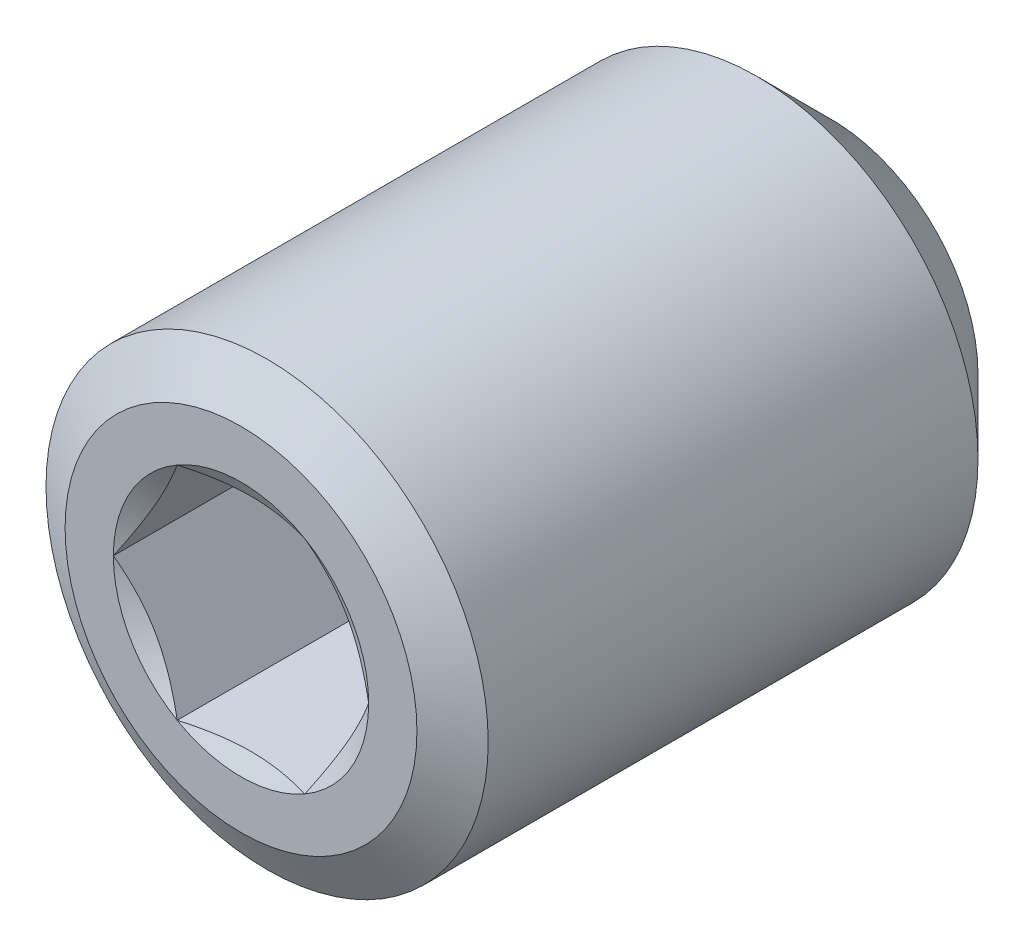
ISO-10303-21;
HEADER;
FILE_DESCRIPTION(('STEP AP214'),'2;1');
FILE_NAME('part.step','',(''),(''),'','','');
FILE_SCHEMA(('AUTOMOTIVE_DESIGN { 1 0 10303 214 1 1 1 1 }'));
ENDSEC;
DATA;
#1=APPLICATION_CONTEXT('core data for automotive mechanical design processes');
#2=APPLICATION_PROTOCOL_DEFINITION('international standard','automotive_design',2000,#1);
#3=PRODUCT_CONTEXT('',#1,'mechanical');
#4=PRODUCT('Part','Part','',(#3));
#5=PRODUCT_RELATED_PRODUCT_CATEGORY('part','',(#4));
#6=PRODUCT_DEFINITION_FORMATION('','',#4);
#7=PRODUCT_DEFINITION_CONTEXT('part definition',#1,'design');
#8=PRODUCT_DEFINITION('design','',#6,#7);
#9=PRODUCT_DEFINITION_SHAPE('','',#8);
#10=(LENGTH_UNIT() NAMED_UNIT(*) SI_UNIT(.MILLI.,.METRE.));
#11=(NAMED_UNIT(*) PLANE_ANGLE_UNIT() SI_UNIT($,.RADIAN.));
#12=(NAMED_UNIT(*) SI_UNIT($,.STERADIAN.) SOLID_ANGLE_UNIT());
#13=UNCERTAINTY_MEASURE_WITH_UNIT(LENGTH_MEASURE(1.E-05),#10,'distance_accuracy_value','');
#14=(GEOMETRIC_REPRESENTATION_CONTEXT(3) GLOBAL_UNCERTAINTY_ASSIGNED_CONTEXT((#13)) GLOBAL_UNIT_ASSIGNED_CONTEXT((#10,
#11,#12)) REPRESENTATION_CONTEXT('',''));
#15=CARTESIAN_POINT('',(0.,0.,0.));
#16=DIRECTION('',(0.,0.,1.));
#17=DIRECTION('',(1.,0.,0.));
#18=AXIS2_PLACEMENT_3D('',#15,#16,#17);
#19=CARTESIAN_POINT('',(5.4,0.,6.05));
#20=DIRECTION('',(0.,0.,-1.));
#21=DIRECTION('',(-1.,0.,0.));
#22=AXIS2_PLACEMENT_3D('',#19,#20,#21);
#23=PLANE('',#22);
#24=DIRECTION('',(1.,0.,0.));
#25=VECTOR('',#24,1.);
#26=CARTESIAN_POINT('',(5.83301270189222,0.75,6.05));
#27=LINE('',#26,#25);
#28=CARTESIAN_POINT('',(5.83301270189222,0.75,6.05));
#29=VERTEX_POINT('',#28);
#30=CARTESIAN_POINT('',(4.96698729810778,0.75,6.05));
#31=VERTEX_POINT('',#30);
#32=EDGE_CURVE('E115',#29,#31,#27,.F.);
#33=ORIENTED_EDGE('',*,*,#32,.T.);
#34=DIRECTION('',(-0.5,-0.866025403784439,0.));
#35=VECTOR('',#34,1.);
#36=CARTESIAN_POINT('',(4.96698729810778,0.75,6.05));
#37=LINE('',#36,#35);
#38=CARTESIAN_POINT('',(4.53397459621556,0.,6.05));
#39=VERTEX_POINT('',#38);
#40=EDGE_CURVE('E81',#31,#39,#37,.T.);
#41=ORIENTED_EDGE('',*,*,#40,.T.);
#42=DIRECTION('',(0.5,-0.866025403784439,0.));
#43=VECTOR('',#42,1.);
#44=CARTESIAN_POINT('',(4.53397459621556,0.,6.05));
#45=LINE('',#44,#43);
#46=CARTESIAN_POINT('',(4.96698729810778,-0.75,6.05));
#47=VERTEX_POINT('',#46);
#48=EDGE_CURVE('E83',#39,#47,#45,.T.);
#49=ORIENTED_EDGE('',*,*,#48,.T.);
#50=DIRECTION('',(1.,0.,0.));
#51=VECTOR('',#50,1.);
#52=CARTESIAN_POINT('',(4.96698729810778,-0.75,6.05));
#53=LINE('',#52,#51);
#54=CARTESIAN_POINT('',(5.83301270189222,-0.75,6.05));
#55=VERTEX_POINT('',#54);
#56=EDGE_CURVE('E84',#47,#55,#53,.T.);
#57=ORIENTED_EDGE('',*,*,#56,.T.);
#58=DIRECTION('',(0.5,0.866025403784439,0.));
#59=VECTOR('',#58,1.);
#60=CARTESIAN_POINT('',(5.83301270189222,-0.75,6.05));
#61=LINE('',#60,#59);
#62=CARTESIAN_POINT('',(6.26602540378444,0.,6.05));
#63=VERTEX_POINT('',#62);
#64=EDGE_CURVE('E70',#55,#63,#61,.T.);
#65=ORIENTED_EDGE('',*,*,#64,.T.);
#66=DIRECTION('',(-0.5,0.866025403784439,0.));
#67=VECTOR('',#66,1.);
#68=CARTESIAN_POINT('',(6.26602540378444,0.,6.05));
#69=LINE('',#68,#67);
#70=EDGE_CURVE('E104',#63,#29,#69,.T.);
#71=ORIENTED_EDGE('',*,*,#70,.T.);
#72=EDGE_LOOP('',(#33,#41,#49,#57,#65,#71));
#73=FACE_BOUND('',#72,.T.);
#74=ADVANCED_FACE('F16',(#73),#23,.F.);
#75=CARTESIAN_POINT('',(4.96698729810778,-0.75,7.25));
#76=DIRECTION('',(0.,-1.,0.));
#77=DIRECTION('',(0.,0.,-1.));
#78=AXIS2_PLACEMENT_3D('',#75,#76,#77);
#79=PLANE('',#78);
#80=DIRECTION('',(0.,0.,1.));
#81=VECTOR('',#80,1.);
#82=CARTESIAN_POINT('',(5.83301270189222,-0.75,7.25));
#83=LINE('',#82,#81);
#84=CARTESIAN_POINT('',(5.83301270188439,-0.750000000021348,7.24999999999327));
#85=VERTEX_POINT('',#84);
#86=EDGE_CURVE('E90',#85,#55,#83,.F.);
#87=ORIENTED_EDGE('',*,*,#86,.T.);
#88=ORIENTED_EDGE('',*,*,#56,.F.);
#89=DIRECTION('',(0.,0.,1.));
#90=VECTOR('',#89,1.);
#91=CARTESIAN_POINT('',(4.96698729810778,-0.750000000000001,7.25));
#92=LINE('',#91,#90);
#93=CARTESIAN_POINT('',(4.96698729810162,-0.750000000010674,7.24999999999197));
#94=VERTEX_POINT('',#93);
#95=EDGE_CURVE('E57',#47,#94,#92,.T.);
#96=ORIENTED_EDGE('',*,*,#95,.T.);
#97=CARTESIAN_POINT('',(4.9669872980988,-0.75,7.24999999998745));
#98=CARTESIAN_POINT('',(5.00253334717891,-0.75,7.23973766481819));
#99=CARTESIAN_POINT('',(5.03836059706336,-0.75,7.23034220746279));
#100=CARTESIAN_POINT('',(5.11059708569754,-0.75,7.21373690236903));
#101=CARTESIAN_POINT('',(5.14700743833595,-0.75,7.20653194479867));
#102=CARTESIAN_POINT('',(5.21941958688233,-0.75,7.19494550076308));
#103=CARTESIAN_POINT('',(5.2554111877375,-0.75,7.19050224022856));
#104=CARTESIAN_POINT('',(5.32760203793876,-0.75,7.18453742650338));
#105=CARTESIAN_POINT('',(5.36380101896938,-0.75,7.18301270190296));
#106=CARTESIAN_POINT('',(5.43619898103062,-0.75,7.18301270190296));
#107=CARTESIAN_POINT('',(5.47239796206124,-0.75,7.18453742650338));
#108=CARTESIAN_POINT('',(5.5445888122625,-0.75,7.19050224022856));
#109=CARTESIAN_POINT('',(5.58058041311767,-0.75,7.19494550076308));
#110=CARTESIAN_POINT('',(5.65299256166405,-0.75,7.20653194479867));
#111=CARTESIAN_POINT('',(5.68940291430246,-0.75,7.21373690236903));
#112=CARTESIAN_POINT('',(5.76163940293664,-0.75,7.23034220746279));
#113=CARTESIAN_POINT('',(5.79746665282109,-0.75,7.23973766481819));
#114=CARTESIAN_POINT('',(5.8330127019012,-0.75,7.24999999998745));
#115=B_SPLINE_CURVE_WITH_KNOTS('',3,(#97,#98,#99,#100,#101,#102,#103,#104,#105,#106,#107,#108,
#109,#110,#111,#112,#113,#114),.UNSPECIFIED.,.F.,.F.,(4,2,2,2,2,2,2,2,4),(0.,0.111027523469266,
0.22230111978337,0.330986572190884,0.439553855000989,0.548121137811092,0.656806590218607,
0.76808018653271,0.879107710001977),.UNSPECIFIED.);
#116=EDGE_CURVE('E19',#94,#85,#115,.T.);
#117=ORIENTED_EDGE('',*,*,#116,.T.);
#118=EDGE_LOOP('',(#87,#88,#96,#117));
#119=FACE_BOUND('',#118,.T.);
#120=ADVANCED_FACE('F88',(#119),#79,.F.);
#121=CARTESIAN_POINT('',(4.53397459621556,0.,7.25));
#122=DIRECTION('',(-0.866025403784439,-0.5,0.));
#123=DIRECTION('',(0.5,-0.866025403784439,0.));
#124=AXIS2_PLACEMENT_3D('',#121,#122,#123);
#125=PLANE('',#124);
#126=ORIENTED_EDGE('',*,*,#95,.F.);
#127=ORIENTED_EDGE('',*,*,#48,.F.);
#128=DIRECTION('',(0.,0.,1.));
#129=VECTOR('',#128,1.);
#130=CARTESIAN_POINT('',(4.53397459621556,0.,7.25));
#131=LINE('',#130,#129);
#132=CARTESIAN_POINT('',(4.53397459620324,0.,7.24999999999198));
#133=VERTEX_POINT('',#132);
#134=EDGE_CURVE('E96',#39,#133,#131,.T.);
#135=ORIENTED_EDGE('',*,*,#134,.T.);
#136=CARTESIAN_POINT('',(4.53397459621107,7.77943498805096E-12,7.24999999998745));
#137=CARTESIAN_POINT('',(4.55300288191491,-0.032957957612204,7.23901082827139));
#138=CARTESIAN_POINT('',(4.57219541962215,-0.0662004080473294,7.22901675266053));
#139=CARTESIAN_POINT('',(4.6109128010648,-0.133260879842023,7.21157239449462));
#140=CARTESIAN_POINT('',(4.6304383325094,-0.167080092348855,7.20412828242054));
#141=CARTESIAN_POINT('',(4.66924742519736,-0.234299412680046,7.19254098480828));
#142=CARTESIAN_POINT('',(4.68852501683877,-0.267689180850539,7.18832067040491));
#143=CARTESIAN_POINT('',(4.72717086025428,-0.334625745147563,7.18328343799773));
#144=CARTESIAN_POINT('',(4.74653897165761,-0.368172298144784,7.18246234772907));
#145=CARTESIAN_POINT('',(4.78272621005057,-0.430850433626996,7.18417485882044));
#146=CARTESIAN_POINT('',(4.79955076723076,-0.459991421477929,7.18628798195908));
#147=CARTESIAN_POINT('',(4.83309027509029,-0.518083553151491,7.19298398776408));
#148=CARTESIAN_POINT('',(4.84980510985202,-0.547034496198918,7.19756915553422));
#149=CARTESIAN_POINT('',(4.88341371226155,-0.605246303143615,7.20903118749734));
#150=CARTESIAN_POINT('',(4.90030322843297,-0.634499803267769,7.21595661582554));
#151=CARTESIAN_POINT('',(4.93383042649982,-0.69257061375497,7.23167441030472));
#152=CARTESIAN_POINT('',(4.95046853758607,-0.721388667498331,7.24046308577011));
#153=CARTESIAN_POINT('',(4.96698729811227,-0.75000000000778,7.24999999998745));
#154=B_SPLINE_CURVE_WITH_KNOTS('',3,(#136,#137,#138,#139,#140,#141,#142,#143,#144,#145,#146,
#147,#148,#149,#150,#151,#152,#153),.UNSPECIFIED.,.F.,.F.,(4,2,2,2,2,2,2,2,4),(0.,
0.118881004361371,0.238047681444984,0.354265352364139,0.470340333390544,0.571390418547985,
0.672534072741057,0.775920608507762,0.879104240149057),.UNSPECIFIED.);
#155=EDGE_CURVE('E94',#133,#94,#154,.T.);
#156=ORIENTED_EDGE('',*,*,#155,.T.);
#157=EDGE_LOOP('',(#126,#127,#135,#156));
#158=FACE_BOUND('',#157,.T.);
#159=ADVANCED_FACE('F92',(#158),#125,.F.);
#160=CARTESIAN_POINT('',(4.96698729810778,0.75,7.25));
#161=DIRECTION('',(-0.866025403784439,0.5,0.));
#162=DIRECTION('',(-0.5,-0.866025403784439,0.));
#163=AXIS2_PLACEMENT_3D('',#160,#161,#162);
#164=PLANE('',#163);
#165=ORIENTED_EDGE('',*,*,#134,.F.);
#166=ORIENTED_EDGE('',*,*,#40,.F.);
#167=DIRECTION('',(0.,0.,1.));
#168=VECTOR('',#167,1.);
#169=CARTESIAN_POINT('',(4.96698729810778,0.75,7.25));
#170=LINE('',#169,#168);
#171=CARTESIAN_POINT('',(4.96698729810162,0.750000000010674,7.25000000000399));
#172=VERTEX_POINT('',#171);
#173=EDGE_CURVE('E107',#31,#172,#170,.T.);
#174=ORIENTED_EDGE('',*,*,#173,.T.);
#175=CARTESIAN_POINT('',(4.96698729811396,0.750000000007282,7.24999999998869));
#176=CARTESIAN_POINT('',(4.94795901240921,0.717042042387903,7.23901082827192));
#177=CARTESIAN_POINT('',(4.92876647470155,0.683799591952969,7.22901675266074));
#178=CARTESIAN_POINT('',(4.89004909325854,0.616739120158301,7.21157239449456));
#179=CARTESIAN_POINT('',(4.87052356181398,0.582919907651304,7.20412828242054));
#180=CARTESIAN_POINT('',(4.831714469126,0.515700587319896,7.1925409848083));
#181=CARTESIAN_POINT('',(4.81243687748452,0.482310819149349,7.18832067040491));
#182=CARTESIAN_POINT('',(4.7737910340689,0.415374254852188,7.18328343799771));
#183=CARTESIAN_POINT('',(4.75442292266553,0.381827701854886,7.18246234772906));
#184=CARTESIAN_POINT('',(4.71823568427256,0.319149566372631,7.18417485882047));
#185=CARTESIAN_POINT('',(4.70141112709239,0.290008578521736,7.18628798195911));
#186=CARTESIAN_POINT('',(4.6678716192329,0.231916446848253,7.19298398776411));
#187=CARTESIAN_POINT('',(4.6511567844712,0.202965503800866,7.19756915553425));
#188=CARTESIAN_POINT('',(4.6175481820617,0.14475369685624,7.20903118749737));
#189=CARTESIAN_POINT('',(4.6006586658903,0.115500196732118,7.21595661582557));
#190=CARTESIAN_POINT('',(4.56713146782349,0.0574293862449759,7.23167441030473));
#191=CARTESIAN_POINT('',(4.55049335673726,0.0286113325016429,7.24046308577012));
#192=CARTESIAN_POINT('',(4.53397459621107,-7.77990301743667E-12,7.24999999998745));
#193=B_SPLINE_CURVE_WITH_KNOTS('',3,(#175,#176,#177,#178,#179,#180,#181,#182,#183,#184,#185,
#186,#187,#188,#189,#190,#191,#192),.UNSPECIFIED.,.F.,.F.,(4,2,2,2,2,2,2,2,4),(0.,
0.118881004361718,0.238047681445647,0.354265352365056,0.470340333391725,0.571390418549038,
0.672534072741974,0.775920608508569,0.879104240149767),.UNSPECIFIED.);
#194=EDGE_CURVE('E189',#172,#133,#193,.T.);
#195=ORIENTED_EDGE('',*,*,#194,.T.);
#196=EDGE_LOOP('',(#165,#166,#174,#195));
#197=FACE_BOUND('',#196,.T.);
#198=ADVANCED_FACE('F198',(#197),#164,.F.);
#199=CARTESIAN_POINT('',(5.83301270189222,0.75,7.25));
#200=DIRECTION('',(0.,1.,0.));
#201=DIRECTION('',(0.,0.,1.));
#202=AXIS2_PLACEMENT_3D('',#199,#200,#201);
#203=PLANE('',#202);
#204=ORIENTED_EDGE('',*,*,#173,.F.);
#205=ORIENTED_EDGE('',*,*,#32,.F.);
#206=DIRECTION('',(0.,0.,1.));
#207=VECTOR('',#206,1.);
#208=CARTESIAN_POINT('',(5.83301270189222,0.750000000000001,7.25));
#209=LINE('',#208,#207);
#210=CARTESIAN_POINT('',(5.83301270189222,0.750000000000001,7.2500000000204));
#211=VERTEX_POINT('',#210);
#212=EDGE_CURVE('E106',#29,#211,#209,.T.);
#213=ORIENTED_EDGE('',*,*,#212,.T.);
#214=CARTESIAN_POINT('',(5.8330127018994,0.75,7.25000000001096));
#215=CARTESIAN_POINT('',(5.79746665281979,0.75,7.23973766483822));
#216=CARTESIAN_POINT('',(5.76163940293568,0.75,7.23034220747957));
#217=CARTESIAN_POINT('',(5.68940291430177,0.75,7.21373690237998));
#218=CARTESIAN_POINT('',(5.65299256166328,0.75,7.20653194480705));
#219=CARTESIAN_POINT('',(5.58058041311704,0.75,7.1949455007674));
#220=CARTESIAN_POINT('',(5.54458881226208,0.75,7.19050224023133));
#221=CARTESIAN_POINT('',(5.4723979620611,0.75,7.18453742650406));
#222=CARTESIAN_POINT('',(5.43619898103055,0.75,7.18301270190311));
#223=CARTESIAN_POINT('',(5.36380101896978,0.75,7.18301270190311));
#224=CARTESIAN_POINT('',(5.32760203793956,0.75,7.18453742650403));
#225=CARTESIAN_POINT('',(5.25541118773924,0.75,7.19050224023119));
#226=CARTESIAN_POINT('',(5.2194195868846,0.75,7.19494550076719));
#227=CARTESIAN_POINT('',(5.147007438339,0.75,7.20653194480663));
#228=CARTESIAN_POINT('',(5.11059708570085,0.75,7.21373690237944));
#229=CARTESIAN_POINT('',(5.03836059706758,0.75,7.23034220747875));
#230=CARTESIAN_POINT('',(5.00253334718378,0.75,7.23973766483726));
#231=CARTESIAN_POINT('',(4.96698729810449,0.75,7.25000000000983));
#232=B_SPLINE_CURVE_WITH_KNOTS('',3,(#214,#215,#216,#217,#218,#219,#220,#221,#222,#223,#224,
#225,#226,#227,#228,#229,#230,#231),.UNSPECIFIED.,.F.,.F.,(4,2,2,2,2,2,2,2,4),(0.,
0.111027523470713,0.222301119786471,0.330986572193851,0.439553855003718,0.548121137812601,
0.65680659021899,0.768080186533711,0.879107710003395),.UNSPECIFIED.);
#233=EDGE_CURVE('E183',#211,#172,#232,.T.);
#234=ORIENTED_EDGE('',*,*,#233,.T.);
#235=EDGE_LOOP('',(#204,#205,#213,#234));
#236=FACE_BOUND('',#235,.T.);
#237=ADVANCED_FACE('F194',(#236),#203,.F.);
#238=CARTESIAN_POINT('',(6.26602540378444,0.,7.25));
#239=DIRECTION('',(0.866025403784439,0.5,0.));
#240=DIRECTION('',(-0.5,0.866025403784439,0.));
#241=AXIS2_PLACEMENT_3D('',#238,#239,#240);
#242=PLANE('',#241);
#243=ORIENTED_EDGE('',*,*,#212,.F.);
#244=ORIENTED_EDGE('',*,*,#70,.F.);
#245=DIRECTION('',(0.,0.,1.));
#246=VECTOR('',#245,1.);
#247=CARTESIAN_POINT('',(6.26602540378444,0.,7.25));
#248=LINE('',#247,#246);
#249=CARTESIAN_POINT('',(6.26602540379676,0.,7.24999999999197));
#250=VERTEX_POINT('',#249);
#251=EDGE_CURVE('E38',#63,#250,#248,.T.);
#252=ORIENTED_EDGE('',*,*,#251,.T.);
#253=CARTESIAN_POINT('',(6.26602540378893,-7.78003067896401E-12,7.24999999998745));
#254=CARTESIAN_POINT('',(6.24699711808509,0.0329579576122044,7.23901082827139));
#255=CARTESIAN_POINT('',(6.22780458037785,0.0662004080473311,7.22901675266053));
#256=CARTESIAN_POINT('',(6.1890871989352,0.133260879842028,7.21157239449461));
#257=CARTESIAN_POINT('',(6.1695616674906,0.167080092348862,7.20412828242054));
#258=CARTESIAN_POINT('',(6.13075257480264,0.234299412680053,7.19254098480828));
#259=CARTESIAN_POINT('',(6.11147498316123,0.267689180850544,7.18832067040491));
#260=CARTESIAN_POINT('',(6.07282913974571,0.334625745147566,7.18328343799773));
#261=CARTESIAN_POINT('',(6.05346102834238,0.368172298144784,7.18246234772907));
#262=CARTESIAN_POINT('',(6.01727378994923,0.430850433627343,7.18417485882045));
#263=CARTESIAN_POINT('',(6.00044923276884,0.459991421478624,7.18628798195913));
#264=CARTESIAN_POINT('',(5.96690972490891,0.518083553152876,7.19298398776426));
#265=CARTESIAN_POINT('',(5.95019489014699,0.547034496200645,7.1975691555345));
#266=CARTESIAN_POINT('',(5.91658628773705,0.605246303146034,7.20903118749787));
#267=CARTESIAN_POINT('',(5.89969677156543,0.634499803270536,7.21595661582622));
#268=CARTESIAN_POINT('',(5.86616957349819,0.692570613758424,7.23167441030572));
#269=CARTESIAN_POINT('',(5.84953146241175,0.721388667502121,7.2404630857713));
#270=CARTESIAN_POINT('',(5.83301270188535,0.750000000011903,7.24999999998882));
#271=B_SPLINE_CURVE_WITH_KNOTS('',3,(#253,#254,#255,#256,#257,#258,#259,#260,#261,#262,#263,
#264,#265,#266,#267,#268,#269,#270),.UNSPECIFIED.,.F.,.F.,(4,2,2,2,2,2,2,2,4),(0.,
0.118881004361375,0.238047681444995,0.354265352364145,0.470340333390544,0.57139041854919,
0.672534072743474,0.775920608511453,0.879104240154011),.UNSPECIFIED.);
#272=EDGE_CURVE('E154',#250,#211,#271,.T.);
#273=ORIENTED_EDGE('',*,*,#272,.T.);
#274=EDGE_LOOP('',(#243,#244,#252,#273));
#275=FACE_BOUND('',#274,.T.);
#276=ADVANCED_FACE('F197',(#275),#242,.F.);
#277=CARTESIAN_POINT('',(5.83301270189222,-0.75,7.25));
#278=DIRECTION('',(0.866025403784439,-0.5,0.));
#279=DIRECTION('',(0.5,0.866025403784439,0.));
#280=AXIS2_PLACEMENT_3D('',#277,#278,#279);
#281=PLANE('',#280);
#282=ORIENTED_EDGE('',*,*,#251,.F.);
#283=ORIENTED_EDGE('',*,*,#64,.F.);
#284=ORIENTED_EDGE('',*,*,#86,.F.);
#285=CARTESIAN_POINT('',(5.83301270188773,-0.750000000007781,7.24999999998745));
#286=CARTESIAN_POINT('',(5.85204098759157,-0.717042042387797,7.23901082827139));
#287=CARTESIAN_POINT('',(5.87123352529881,-0.683799591952672,7.22901675266053));
#288=CARTESIAN_POINT('',(5.90995090674146,-0.616739120157978,7.21157239449461));
#289=CARTESIAN_POINT('',(5.92947643818606,-0.582919907651146,7.20412828242054));
#290=CARTESIAN_POINT('',(5.96828553087401,-0.515700587319955,7.19254098480828));
#291=CARTESIAN_POINT('',(5.98756312251543,-0.482310819149462,7.18832067040491));
#292=CARTESIAN_POINT('',(6.02620896593094,-0.415374254852438,7.18328343799773));
#293=CARTESIAN_POINT('',(6.04557707733427,-0.381827701855217,7.18246234772907));
#294=CARTESIAN_POINT('',(6.08176431572723,-0.319149566373006,7.18417485882044));
#295=CARTESIAN_POINT('',(6.09858887290742,-0.290008578522072,7.18628798195908));
#296=CARTESIAN_POINT('',(6.13212838076695,-0.23191644684851,7.19298398776407));
#297=CARTESIAN_POINT('',(6.14884321552868,-0.202965503801082,7.19756915553421));
#298=CARTESIAN_POINT('',(6.18245181793821,-0.144753696856385,7.20903118749734));
#299=CARTESIAN_POINT('',(6.19934133410963,-0.115500196732231,7.21595661582554));
#300=CARTESIAN_POINT('',(6.23286853217648,-0.0574293862450298,7.23167441030472));
#301=CARTESIAN_POINT('',(6.24950664326273,-0.0286113325016693,7.24046308577011));
#302=CARTESIAN_POINT('',(6.26602540378893,7.78025653398684E-12,7.24999999998745));
#303=B_SPLINE_CURVE_WITH_KNOTS('',3,(#285,#286,#287,#288,#289,#290,#291,#292,#293,#294,#295,
#296,#297,#298,#299,#300,#301,#302),.UNSPECIFIED.,.F.,.F.,(4,2,2,2,2,2,2,2,4),(0.,
0.118881004361371,0.238047681444984,0.35426535236414,0.470340333390544,0.571390418547985,
0.672534072741059,0.775920608507764,0.879104240149059),.UNSPECIFIED.);
#304=EDGE_CURVE('E147',#85,#250,#303,.T.);
#305=ORIENTED_EDGE('',*,*,#304,.T.);
#306=EDGE_LOOP('',(#282,#283,#284,#305));
#307=FACE_BOUND('',#306,.T.);
#308=ADVANCED_FACE('F161',(#307),#281,.F.);
#309=CARTESIAN_POINT('',(5.4,0.,7.24999999999909));
#310=DIRECTION('',(0.,0.,1.));
#311=DIRECTION('',(1.,0.,0.));
#312=AXIS2_PLACEMENT_3D('',#309,#310,#311);
#313=CONICAL_SURFACE('',#312,0.86602540380909,1.04719755136393);
#314=ORIENTED_EDGE('',*,*,#116,.F.);
#315=CARTESIAN_POINT('',(5.4,0.,7.24999999999909));
#316=DIRECTION('',(0.,0.,1.));
#317=DIRECTION('',(1.,0.,0.));
#318=AXIS2_PLACEMENT_3D('',#315,#316,#317);
#319=CIRCLE('',#318,0.86602540380909);
#320=EDGE_CURVE('E144',#85,#94,#319,.F.);
#321=ORIENTED_EDGE('',*,*,#320,.F.);
#322=EDGE_LOOP('',(#314,#321));
#323=FACE_BOUND('',#322,.T.);
#324=ADVANCED_FACE('F214',(#323),#313,.F.);
#325=CARTESIAN_POINT('',(5.4,0.,7.24999999999909));
#326=DIRECTION('',(0.,0.,1.));
#327=DIRECTION('',(1.,0.,0.));
#328=AXIS2_PLACEMENT_3D('',#325,#326,#327);
#329=CONICAL_SURFACE('',#328,0.86602540380909,1.04719755130704);
#330=CARTESIAN_POINT('',(5.4,0.,7.24999999999909));
#331=DIRECTION('',(0.,0.,1.));
#332=DIRECTION('',(1.,0.,0.));
#333=AXIS2_PLACEMENT_3D('',#330,#331,#332);
#334=CIRCLE('',#333,0.86602540380909);
#335=EDGE_CURVE('E141',#94,#133,#334,.F.);
#336=ORIENTED_EDGE('',*,*,#335,.F.);
#337=ORIENTED_EDGE('',*,*,#155,.F.);
#338=EDGE_LOOP('',(#336,#337));
#339=FACE_BOUND('',#338,.T.);
#340=ADVANCED_FACE('F211',(#339),#329,.F.);
#341=CARTESIAN_POINT('',(5.4,0.,7.24999999999909));
#342=DIRECTION('',(0.,0.,1.));
#343=DIRECTION('',(1.,0.,0.));
#344=AXIS2_PLACEMENT_3D('',#341,#342,#343);
#345=CONICAL_SURFACE('',#344,0.86602540380909,1.04719755130704);
#346=CARTESIAN_POINT('',(5.4,0.,7.24999999999909));
#347=DIRECTION('',(0.,0.,1.));
#348=DIRECTION('',(1.,0.,0.));
#349=AXIS2_PLACEMENT_3D('',#346,#347,#348);
#350=CIRCLE('',#349,0.86602540380909);
#351=EDGE_CURVE('E138',#133,#172,#350,.F.);
#352=ORIENTED_EDGE('',*,*,#351,.F.);
#353=ORIENTED_EDGE('',*,*,#194,.F.);
#354=EDGE_LOOP('',(#352,#353));
#355=FACE_BOUND('',#354,.T.);
#356=ADVANCED_FACE('F179',(#355),#345,.F.);
#357=CARTESIAN_POINT('',(5.4,0.,7.25000000005593));
#358=DIRECTION('',(0.,0.,1.));
#359=DIRECTION('',(1.,0.,0.));
#360=AXIS2_PLACEMENT_3D('',#357,#358,#359);
#361=CONICAL_SURFACE('',#360,0.866025403865933,1.04719755120955);
#362=ORIENTED_EDGE('',*,*,#233,.F.);
#363=CARTESIAN_POINT('',(5.4,0.,7.25000000005593));
#364=DIRECTION('',(0.,0.,1.));
#365=DIRECTION('',(1.,0.,0.));
#366=AXIS2_PLACEMENT_3D('',#363,#364,#365);
#367=CIRCLE('',#366,0.866025403865933);
#368=EDGE_CURVE('E135',#172,#211,#367,.F.);
#369=ORIENTED_EDGE('',*,*,#368,.F.);
#370=EDGE_LOOP('',(#362,#369));
#371=FACE_BOUND('',#370,.T.);
#372=ADVANCED_FACE('F174',(#371),#361,.F.);
#373=CARTESIAN_POINT('',(5.4,0.,7.24999999999909));
#374=DIRECTION('',(0.,0.,1.));
#375=DIRECTION('',(1.,0.,0.));
#376=AXIS2_PLACEMENT_3D('',#373,#374,#375);
#377=CONICAL_SURFACE('',#376,0.86602540380909,1.04719755130704);
#378=CARTESIAN_POINT('',(5.4,0.,7.24999999999909));
#379=DIRECTION('',(0.,0.,1.));
#380=DIRECTION('',(1.,0.,0.));
#381=AXIS2_PLACEMENT_3D('',#378,#379,#380);
#382=CIRCLE('',#381,0.86602540380909);
#383=EDGE_CURVE('E132',#211,#250,#382,.F.);
#384=ORIENTED_EDGE('',*,*,#383,.F.);
#385=ORIENTED_EDGE('',*,*,#272,.F.);
#386=EDGE_LOOP('',(#384,#385));
#387=FACE_BOUND('',#386,.T.);
#388=ADVANCED_FACE('F168',(#387),#377,.F.);
#389=CARTESIAN_POINT('',(5.4,0.,7.24999999999909));
#390=DIRECTION('',(0.,0.,1.));
#391=DIRECTION('',(1.,0.,0.));
#392=AXIS2_PLACEMENT_3D('',#389,#390,#391);
#393=CONICAL_SURFACE('',#392,0.86602540380909,1.04719755130704);
#394=CARTESIAN_POINT('',(5.4,0.,7.24999999999909));
#395=DIRECTION('',(0.,0.,1.));
#396=DIRECTION('',(1.,0.,0.));
#397=AXIS2_PLACEMENT_3D('',#394,#395,#396);
#398=CIRCLE('',#397,0.86602540380909);
#399=EDGE_CURVE('E129',#250,#85,#398,.F.);
#400=ORIENTED_EDGE('',*,*,#399,.F.);
#401=ORIENTED_EDGE('',*,*,#304,.F.);
#402=EDGE_LOOP('',(#400,#401));
#403=FACE_BOUND('',#402,.T.);
#404=ADVANCED_FACE('F163',(#403),#393,.F.);
#405=CARTESIAN_POINT('',(5.4,-1.02976270189222,7.25));
#406=DIRECTION('',(0.,0.,1.));
#407=DIRECTION('',(0.,-1.,0.));
#408=AXIS2_PLACEMENT_3D('',#405,#406,#407);
#409=PLANE('',#408);
#410=ORIENTED_EDGE('',*,*,#383,.T.);
#411=ORIENTED_EDGE('',*,*,#399,.T.);
#412=ORIENTED_EDGE('',*,*,#320,.T.);
#413=ORIENTED_EDGE('',*,*,#335,.T.);
#414=ORIENTED_EDGE('',*,*,#351,.T.);
#415=ORIENTED_EDGE('',*,*,#368,.T.);
#416=EDGE_LOOP('',(#410,#411,#412,#413,#414,#415));
#417=FACE_BOUND('',#416,.T.);
#418=CARTESIAN_POINT('',(5.4,0.,7.2499999998854));
#419=DIRECTION('',(0.,0.,-1.));
#420=DIRECTION('',(-1.,0.,0.));
#421=AXIS2_PLACEMENT_3D('',#418,#419,#420);
#422=CIRCLE('',#421,1.19350000011309);
#423=CARTESIAN_POINT('',(4.20649999988691,0.,7.2499999998854));
#424=VERTEX_POINT('',#423);
#425=EDGE_CURVE('E126',#424,#424,#422,.T.);
#426=ORIENTED_EDGE('',*,*,#425,.F.);
#427=EDGE_LOOP('',(#426));
#428=FACE_BOUND('',#427,.T.);
#429=ADVANCED_FACE('F167',(#417,#428),#409,.T.);
#430=CARTESIAN_POINT('',(5.4,-0.5,3.25));
#431=DIRECTION('',(0.,0.,-1.));
#432=DIRECTION('',(-1.,0.,0.));
#433=AXIS2_PLACEMENT_3D('',#430,#431,#432);
#434=PLANE('',#433);
#435=CARTESIAN_POINT('',(5.4,0.,3.25000000003683));
#436=DIRECTION('',(0.,0.,1.));
#437=DIRECTION('',(1.,0.,0.));
#438=AXIS2_PLACEMENT_3D('',#435,#436,#437);
#439=CIRCLE('',#438,1.00000000014688);
#440=CARTESIAN_POINT('',(6.40000000014688,0.,3.25000000003683));
#441=VERTEX_POINT('',#440);
#442=EDGE_CURVE('E123',#441,#441,#439,.T.);
#443=ORIENTED_EDGE('',*,*,#442,.F.);
#444=EDGE_LOOP('',(#443));
#445=FACE_BOUND('',#444,.T.);
#446=ADVANCED_FACE('F239',(#445),#434,.T.);
#447=CARTESIAN_POINT('',(5.4,0.,7.07304214233773));
#448=DIRECTION('',(0.,0.,-1.));
#449=DIRECTION('',(-1.,0.,0.));
#450=AXIS2_PLACEMENT_3D('',#447,#448,#449);
#451=CONICAL_SURFACE('',#450,1.5000000001919,1.04719755120748);
#452=ORIENTED_EDGE('',*,*,#425,.T.);
#453=EDGE_LOOP('',(#452));
#454=FACE_BOUND('',#453,.T.);
#455=CARTESIAN_POINT('',(5.4,0.,7.07304214249338));
#456=DIRECTION('',(0.,0.,1.));
#457=DIRECTION('',(0.,-1.,0.));
#458=AXIS2_PLACEMENT_3D('',#455,#456,#457);
#459=CIRCLE('',#458,1.5);
#460=CARTESIAN_POINT('',(5.4,-1.5,7.07304214249338));
#461=VERTEX_POINT('',#460);
#462=EDGE_CURVE('E29',#461,#461,#459,.F.);
#463=ORIENTED_EDGE('',*,*,#462,.F.);
#464=EDGE_LOOP('',(#463));
#465=FACE_BOUND('',#464,.T.);
#466=ADVANCED_FACE('F232',(#454,#465),#451,.T.);
#467=CARTESIAN_POINT('',(5.4,0.,3.75000000008185));
#468=DIRECTION('',(0.,0.,1.));
#469=DIRECTION('',(1.,0.,0.));
#470=AXIS2_PLACEMENT_3D('',#467,#468,#469);
#471=CONICAL_SURFACE('',#470,1.50000000013506,0.785398163340605);
#472=ORIENTED_EDGE('',*,*,#442,.T.);
#473=EDGE_LOOP('',(#472));
#474=FACE_BOUND('',#473,.T.);
#475=CARTESIAN_POINT('',(5.4,0.,3.75));
#476=DIRECTION('',(0.,0.,1.));
#477=DIRECTION('',(0.,-1.,0.));
#478=AXIS2_PLACEMENT_3D('',#475,#476,#477);
#479=CIRCLE('',#478,1.5);
#480=CARTESIAN_POINT('',(5.4,-1.5,3.75));
#481=VERTEX_POINT('',#480);
#482=EDGE_CURVE('E10',#481,#481,#479,.T.);
#483=ORIENTED_EDGE('',*,*,#482,.F.);
#484=EDGE_LOOP('',(#483));
#485=FACE_BOUND('',#484,.T.);
#486=ADVANCED_FACE('F226',(#474,#485),#471,.T.);
#487=CARTESIAN_POINT('',(5.4,0.,5.41152107124669));
#488=DIRECTION('',(0.,0.,1.));
#489=DIRECTION('',(0.,-1.,0.));
#490=AXIS2_PLACEMENT_3D('',#487,#488,#489);
#491=CYLINDRICAL_SURFACE('',#490,1.5);
#492=ORIENTED_EDGE('',*,*,#462,.T.);
#493=EDGE_LOOP('',(#492));
#494=FACE_BOUND('',#493,.T.);
#495=ORIENTED_EDGE('',*,*,#482,.T.);
#496=EDGE_LOOP('',(#495));
#497=FACE_BOUND('',#496,.T.);
#498=ADVANCED_FACE('F224',(#494,#497),#491,.T.);
#499=CLOSED_SHELL('',(#74,#120,#159,#198,#237,#276,#308,#324,#340,#356,#372,#388,#404,#429,#446,
#466,#486,#498));
#500=MANIFOLD_SOLID_BREP('B1',#499);
#501=ADVANCED_BREP_SHAPE_REPRESENTATION('',(#18,#500),#14);
#502=SHAPE_DEFINITION_REPRESENTATION(#9,#501);
ENDSEC;
END-ISO-10303-21;
